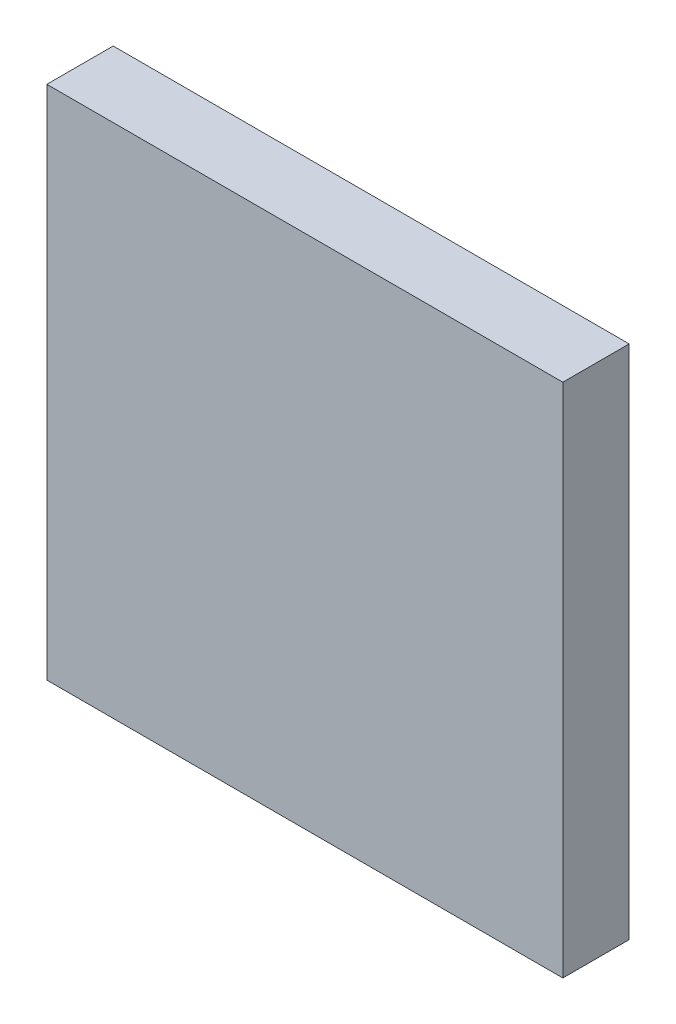
ISO-10303-21;
HEADER;
FILE_DESCRIPTION(('STEP AP214'),'2;1');
FILE_NAME('part.step','',(''),(''),'','','');
FILE_SCHEMA(('AUTOMOTIVE_DESIGN { 1 0 10303 214 1 1 1 1 }'));
ENDSEC;
DATA;
#1=APPLICATION_CONTEXT('core data for automotive mechanical design processes');
#2=APPLICATION_PROTOCOL_DEFINITION('international standard','automotive_design',2000,#1);
#3=PRODUCT_CONTEXT('',#1,'mechanical');
#4=PRODUCT('Part','Part','',(#3));
#5=PRODUCT_RELATED_PRODUCT_CATEGORY('part','',(#4));
#6=PRODUCT_DEFINITION_FORMATION('','',#4);
#7=PRODUCT_DEFINITION_CONTEXT('part definition',#1,'design');
#8=PRODUCT_DEFINITION('design','',#6,#7);
#9=PRODUCT_DEFINITION_SHAPE('','',#8);
#10=(LENGTH_UNIT() NAMED_UNIT(*) SI_UNIT(.MILLI.,.METRE.));
#11=(NAMED_UNIT(*) PLANE_ANGLE_UNIT() SI_UNIT($,.RADIAN.));
#12=(NAMED_UNIT(*) SI_UNIT($,.STERADIAN.) SOLID_ANGLE_UNIT());
#13=UNCERTAINTY_MEASURE_WITH_UNIT(LENGTH_MEASURE(1.E-05),#10,'distance_accuracy_value','');
#14=(GEOMETRIC_REPRESENTATION_CONTEXT(3) GLOBAL_UNCERTAINTY_ASSIGNED_CONTEXT((#13)) GLOBAL_UNIT_ASSIGNED_CONTEXT((#10,
#11,#12)) REPRESENTATION_CONTEXT('',''));
#15=CARTESIAN_POINT('',(0.,0.,0.));
#16=DIRECTION('',(0.,0.,1.));
#17=DIRECTION('',(1.,0.,0.));
#18=AXIS2_PLACEMENT_3D('',#15,#16,#17);
#19=CARTESIAN_POINT('',(-3.49999808,3.50000062,0.));
#20=DIRECTION('',(1.,0.,0.));
#21=DIRECTION('',(0.,-1.,0.));
#22=AXIS2_PLACEMENT_3D('',#19,#20,#21);
#23=PLANE('',#22);
#24=DIRECTION('',(0.,-1.,0.));
#25=VECTOR('',#24,1.);
#26=CARTESIAN_POINT('',(-3.49999808,3.50000062,0.));
#27=LINE('',#26,#25);
#28=CARTESIAN_POINT('',(-3.49999808,3.50000062,0.));
#29=VERTEX_POINT('',#28);
#30=CARTESIAN_POINT('',(-3.49999808,-3.49999808,0.));
#31=VERTEX_POINT('',#30);
#32=EDGE_CURVE('E9',#29,#31,#27,.T.);
#33=ORIENTED_EDGE('',*,*,#32,.T.);
#34=DIRECTION('',(0.,0.,1.));
#35=VECTOR('',#34,1.);
#36=CARTESIAN_POINT('',(-3.49999808,-3.49999808,0.));
#37=LINE('',#36,#35);
#38=CARTESIAN_POINT('',(-3.49999808,-3.49999808,0.90000074));
#39=VERTEX_POINT('',#38);
#40=EDGE_CURVE('E22',#31,#39,#37,.T.);
#41=ORIENTED_EDGE('',*,*,#40,.T.);
#42=DIRECTION('',(0.,-1.,0.));
#43=VECTOR('',#42,1.);
#44=CARTESIAN_POINT('',(-3.49999808,3.50000062,0.90000074));
#45=LINE('',#44,#43);
#46=CARTESIAN_POINT('',(-3.49999808,3.50000062,0.90000074));
#47=VERTEX_POINT('',#46);
#48=EDGE_CURVE('E85',#47,#39,#45,.T.);
#49=ORIENTED_EDGE('',*,*,#48,.F.);
#50=DIRECTION('',(0.,0.,1.));
#51=VECTOR('',#50,1.);
#52=CARTESIAN_POINT('',(-3.49999808,3.50000062,0.));
#53=LINE('',#52,#51);
#54=EDGE_CURVE('E34',#29,#47,#53,.T.);
#55=ORIENTED_EDGE('',*,*,#54,.F.);
#56=EDGE_LOOP('',(#33,#41,#49,#55));
#57=FACE_BOUND('',#56,.T.);
#58=ADVANCED_FACE('F15',(#57),#23,.F.);
#59=CARTESIAN_POINT('',(-3.49999808,-3.49999808,0.));
#60=DIRECTION('',(0.,1.,0.));
#61=DIRECTION('',(1.,0.,0.));
#62=AXIS2_PLACEMENT_3D('',#59,#60,#61);
#63=PLANE('',#62);
#64=DIRECTION('',(1.,0.,0.));
#65=VECTOR('',#64,1.);
#66=CARTESIAN_POINT('',(-3.49999808,-3.49999808,0.));
#67=LINE('',#66,#65);
#68=CARTESIAN_POINT('',(3.50000062,-3.49999808,0.));
#69=VERTEX_POINT('',#68);
#70=EDGE_CURVE('E82',#31,#69,#67,.T.);
#71=ORIENTED_EDGE('',*,*,#70,.T.);
#72=DIRECTION('',(0.,0.,1.));
#73=VECTOR('',#72,1.);
#74=CARTESIAN_POINT('',(3.50000062,-3.49999808,0.));
#75=LINE('',#74,#73);
#76=CARTESIAN_POINT('',(3.50000062,-3.49999808,0.90000074));
#77=VERTEX_POINT('',#76);
#78=EDGE_CURVE('E80',#69,#77,#75,.T.);
#79=ORIENTED_EDGE('',*,*,#78,.T.);
#80=DIRECTION('',(1.,0.,0.));
#81=VECTOR('',#80,1.);
#82=CARTESIAN_POINT('',(-3.49999808,-3.49999808,0.90000074));
#83=LINE('',#82,#81);
#84=EDGE_CURVE('E59',#39,#77,#83,.T.);
#85=ORIENTED_EDGE('',*,*,#84,.F.);
#86=ORIENTED_EDGE('',*,*,#40,.F.);
#87=EDGE_LOOP('',(#71,#79,#85,#86));
#88=FACE_BOUND('',#87,.T.);
#89=ADVANCED_FACE('F87',(#88),#63,.F.);
#90=CARTESIAN_POINT('',(3.50000062,-3.49999808,0.));
#91=DIRECTION('',(-1.,0.,0.));
#92=DIRECTION('',(0.,1.,0.));
#93=AXIS2_PLACEMENT_3D('',#90,#91,#92);
#94=PLANE('',#93);
#95=DIRECTION('',(0.,1.,0.));
#96=VECTOR('',#95,1.);
#97=CARTESIAN_POINT('',(3.50000062,-3.49999808,0.));
#98=LINE('',#97,#96);
#99=CARTESIAN_POINT('',(3.50000062,3.50000062,0.));
#100=VERTEX_POINT('',#99);
#101=EDGE_CURVE('E69',#69,#100,#98,.T.);
#102=ORIENTED_EDGE('',*,*,#101,.T.);
#103=DIRECTION('',(0.,0.,1.));
#104=VECTOR('',#103,1.);
#105=CARTESIAN_POINT('',(3.50000062,3.50000062,0.));
#106=LINE('',#105,#104);
#107=CARTESIAN_POINT('',(3.50000062,3.50000062,0.90000074));
#108=VERTEX_POINT('',#107);
#109=EDGE_CURVE('E63',#100,#108,#106,.T.);
#110=ORIENTED_EDGE('',*,*,#109,.T.);
#111=DIRECTION('',(0.,1.,0.));
#112=VECTOR('',#111,1.);
#113=CARTESIAN_POINT('',(3.50000062,-3.49999808,0.90000074));
#114=LINE('',#113,#112);
#115=EDGE_CURVE('E54',#77,#108,#114,.T.);
#116=ORIENTED_EDGE('',*,*,#115,.F.);
#117=ORIENTED_EDGE('',*,*,#78,.F.);
#118=EDGE_LOOP('',(#102,#110,#116,#117));
#119=FACE_BOUND('',#118,.T.);
#120=ADVANCED_FACE('F67',(#119),#94,.F.);
#121=CARTESIAN_POINT('',(3.50000062,3.50000062,0.));
#122=DIRECTION('',(0.,-1.,0.));
#123=DIRECTION('',(-1.,0.,0.));
#124=AXIS2_PLACEMENT_3D('',#121,#122,#123);
#125=PLANE('',#124);
#126=DIRECTION('',(-1.,0.,0.));
#127=VECTOR('',#126,1.);
#128=CARTESIAN_POINT('',(3.50000062,3.50000062,0.));
#129=LINE('',#128,#127);
#130=EDGE_CURVE('E64',#100,#29,#129,.T.);
#131=ORIENTED_EDGE('',*,*,#130,.T.);
#132=ORIENTED_EDGE('',*,*,#54,.T.);
#133=DIRECTION('',(-1.,0.,0.));
#134=VECTOR('',#133,1.);
#135=CARTESIAN_POINT('',(3.50000062,3.50000062,0.90000074));
#136=LINE('',#135,#134);
#137=EDGE_CURVE('E58',#108,#47,#136,.T.);
#138=ORIENTED_EDGE('',*,*,#137,.F.);
#139=ORIENTED_EDGE('',*,*,#109,.F.);
#140=EDGE_LOOP('',(#131,#132,#138,#139));
#141=FACE_BOUND('',#140,.T.);
#142=ADVANCED_FACE('F74',(#141),#125,.F.);
#143=CARTESIAN_POINT('',(1.270000012565E-06,1.270000005587E-06,0.));
#144=DIRECTION('',(0.,0.,1.));
#145=DIRECTION('',(1.,0.,0.));
#146=AXIS2_PLACEMENT_3D('',#143,#144,#145);
#147=PLANE('',#146);
#148=ORIENTED_EDGE('',*,*,#130,.F.);
#149=ORIENTED_EDGE('',*,*,#101,.F.);
#150=ORIENTED_EDGE('',*,*,#70,.F.);
#151=ORIENTED_EDGE('',*,*,#32,.F.);
#152=EDGE_LOOP('',(#148,#149,#150,#151));
#153=FACE_BOUND('',#152,.T.);
#154=ADVANCED_FACE('F89',(#153),#147,.F.);
#155=CARTESIAN_POINT('',(1.270000012565E-06,1.270000005587E-06,0.90000074));
#156=DIRECTION('',(0.,0.,1.));
#157=DIRECTION('',(1.,0.,0.));
#158=AXIS2_PLACEMENT_3D('',#155,#156,#157);
#159=PLANE('',#158);
#160=ORIENTED_EDGE('',*,*,#48,.T.);
#161=ORIENTED_EDGE('',*,*,#84,.T.);
#162=ORIENTED_EDGE('',*,*,#115,.T.);
#163=ORIENTED_EDGE('',*,*,#137,.T.);
#164=EDGE_LOOP('',(#160,#161,#162,#163));
#165=FACE_BOUND('',#164,.T.);
#166=ADVANCED_FACE('F56',(#165),#159,.T.);
#167=CLOSED_SHELL('',(#58,#89,#120,#142,#154,#166));
#168=MANIFOLD_SOLID_BREP('B1',#167);
#169=ADVANCED_BREP_SHAPE_REPRESENTATION('',(#18,#168),#14);
#170=SHAPE_DEFINITION_REPRESENTATION(#9,#169);
ENDSEC;
END-ISO-10303-21;
